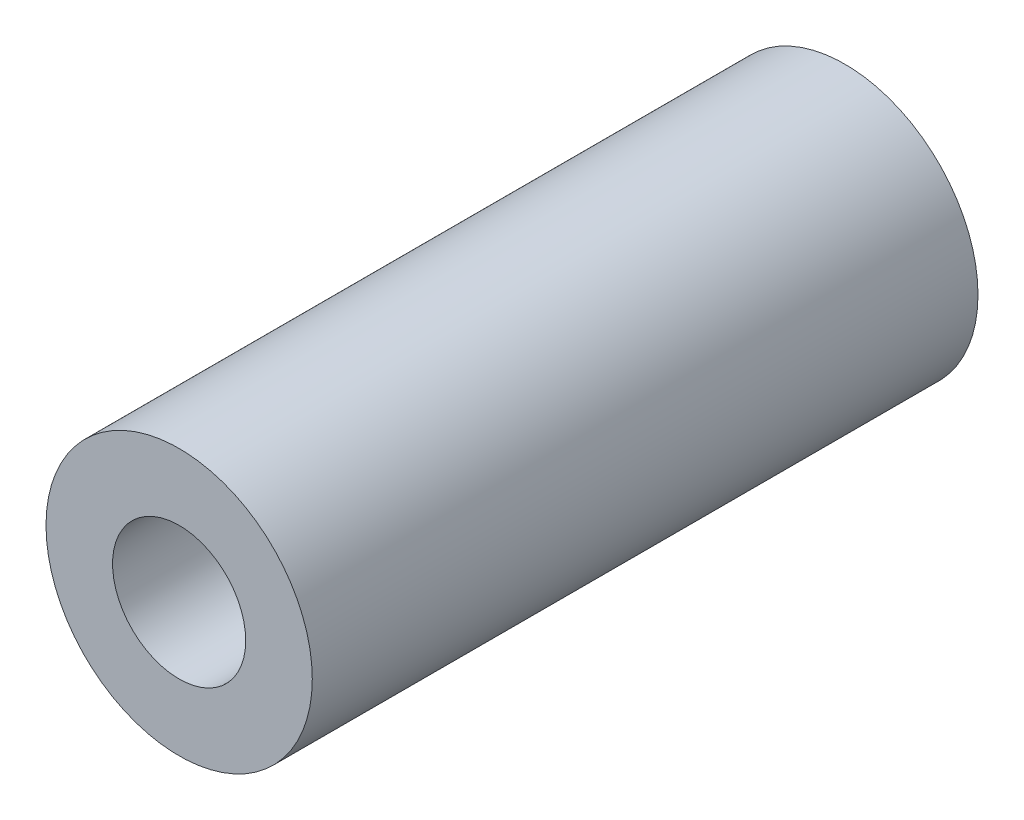
ISO-10303-21;
HEADER;
FILE_DESCRIPTION(('STEP AP214'),'2;1');
FILE_NAME('part.step','',(''),(''),'','','');
FILE_SCHEMA(('AUTOMOTIVE_DESIGN { 1 0 10303 214 1 1 1 1 }'));
ENDSEC;
DATA;
#1=APPLICATION_CONTEXT('core data for automotive mechanical design processes');
#2=APPLICATION_PROTOCOL_DEFINITION('international standard','automotive_design',2000,#1);
#3=PRODUCT_CONTEXT('',#1,'mechanical');
#4=PRODUCT('Part','Part','',(#3));
#5=PRODUCT_RELATED_PRODUCT_CATEGORY('part','',(#4));
#6=PRODUCT_DEFINITION_FORMATION('','',#4);
#7=PRODUCT_DEFINITION_CONTEXT('part definition',#1,'design');
#8=PRODUCT_DEFINITION('design','',#6,#7);
#9=PRODUCT_DEFINITION_SHAPE('','',#8);
#10=(LENGTH_UNIT() NAMED_UNIT(*) SI_UNIT(.MILLI.,.METRE.));
#11=(NAMED_UNIT(*) PLANE_ANGLE_UNIT() SI_UNIT($,.RADIAN.));
#12=(NAMED_UNIT(*) SI_UNIT($,.STERADIAN.) SOLID_ANGLE_UNIT());
#13=UNCERTAINTY_MEASURE_WITH_UNIT(LENGTH_MEASURE(1.E-05),#10,'distance_accuracy_value','');
#14=(GEOMETRIC_REPRESENTATION_CONTEXT(3) GLOBAL_UNCERTAINTY_ASSIGNED_CONTEXT((#13)) GLOBAL_UNIT_ASSIGNED_CONTEXT((#10,
#11,#12)) REPRESENTATION_CONTEXT('',''));
#15=CARTESIAN_POINT('',(0.,0.,0.));
#16=DIRECTION('',(0.,0.,1.));
#17=DIRECTION('',(1.,0.,0.));
#18=AXIS2_PLACEMENT_3D('',#15,#16,#17);
#19=CARTESIAN_POINT('',(0.,0.,10.));
#20=DIRECTION('',(0.,0.,1.));
#21=DIRECTION('',(1.,0.,0.));
#22=AXIS2_PLACEMENT_3D('',#19,#20,#21);
#23=PLANE('',#22);
#24=CARTESIAN_POINT('',(0.,0.,10.));
#25=DIRECTION('',(0.,0.,1.));
#26=DIRECTION('',(1.,0.,0.));
#27=AXIS2_PLACEMENT_3D('',#24,#25,#26);
#28=CIRCLE('',#27,2.);
#29=CARTESIAN_POINT('',(2.,0.,10.));
#30=VERTEX_POINT('',#29);
#31=EDGE_CURVE('E11',#30,#30,#28,.T.);
#32=ORIENTED_EDGE('',*,*,#31,.T.);
#33=EDGE_LOOP('',(#32));
#34=FACE_BOUND('',#33,.T.);
#35=CARTESIAN_POINT('',(0.,0.,10.));
#36=DIRECTION('',(0.,0.,1.));
#37=DIRECTION('',(1.,0.,0.));
#38=AXIS2_PLACEMENT_3D('',#35,#36,#37);
#39=CIRCLE('',#38,1.);
#40=CARTESIAN_POINT('',(1.,0.,10.));
#41=VERTEX_POINT('',#40);
#42=EDGE_CURVE('E48',#41,#41,#39,.T.);
#43=ORIENTED_EDGE('',*,*,#42,.F.);
#44=EDGE_LOOP('',(#43));
#45=FACE_BOUND('',#44,.T.);
#46=ADVANCED_FACE('F37',(#34,#45),#23,.T.);
#47=CARTESIAN_POINT('',(0.,0.,0.));
#48=DIRECTION('',(0.,0.,1.));
#49=DIRECTION('',(1.,0.,0.));
#50=AXIS2_PLACEMENT_3D('',#47,#48,#49);
#51=PLANE('',#50);
#52=CARTESIAN_POINT('',(0.,0.,0.));
#53=DIRECTION('',(0.,0.,1.));
#54=DIRECTION('',(1.,0.,0.));
#55=AXIS2_PLACEMENT_3D('',#52,#53,#54);
#56=CIRCLE('',#55,2.);
#57=CARTESIAN_POINT('',(2.,0.,0.));
#58=VERTEX_POINT('',#57);
#59=EDGE_CURVE('E41',#58,#58,#56,.T.);
#60=ORIENTED_EDGE('',*,*,#59,.F.);
#61=EDGE_LOOP('',(#60));
#62=FACE_BOUND('',#61,.T.);
#63=CARTESIAN_POINT('',(0.,0.,0.));
#64=DIRECTION('',(0.,0.,1.));
#65=DIRECTION('',(1.,0.,0.));
#66=AXIS2_PLACEMENT_3D('',#63,#64,#65);
#67=CIRCLE('',#66,1.);
#68=CARTESIAN_POINT('',(1.,0.,0.));
#69=VERTEX_POINT('',#68);
#70=EDGE_CURVE('E50',#69,#69,#67,.T.);
#71=ORIENTED_EDGE('',*,*,#70,.T.);
#72=EDGE_LOOP('',(#71));
#73=FACE_BOUND('',#72,.T.);
#74=ADVANCED_FACE('F60',(#62,#73),#51,.F.);
#75=CARTESIAN_POINT('',(0.,0.,10.));
#76=DIRECTION('',(0.,0.,-1.));
#77=DIRECTION('',(-1.,0.,0.));
#78=AXIS2_PLACEMENT_3D('',#75,#76,#77);
#79=CYLINDRICAL_SURFACE('',#78,2.);
#80=ORIENTED_EDGE('',*,*,#31,.F.);
#81=EDGE_LOOP('',(#80));
#82=FACE_BOUND('',#81,.T.);
#83=ORIENTED_EDGE('',*,*,#59,.T.);
#84=EDGE_LOOP('',(#83));
#85=FACE_BOUND('',#84,.T.);
#86=ADVANCED_FACE('F39',(#82,#85),#79,.T.);
#87=CARTESIAN_POINT('',(0.,0.,10.));
#88=DIRECTION('',(0.,0.,-1.));
#89=DIRECTION('',(-1.,0.,0.));
#90=AXIS2_PLACEMENT_3D('',#87,#88,#89);
#91=CYLINDRICAL_SURFACE('',#90,1.);
#92=ORIENTED_EDGE('',*,*,#42,.T.);
#93=EDGE_LOOP('',(#92));
#94=FACE_BOUND('',#93,.T.);
#95=ORIENTED_EDGE('',*,*,#70,.F.);
#96=EDGE_LOOP('',(#95));
#97=FACE_BOUND('',#96,.T.);
#98=ADVANCED_FACE('F56',(#94,#97),#91,.F.);
#99=CLOSED_SHELL('',(#46,#74,#86,#98));
#100=MANIFOLD_SOLID_BREP('B2',#99);
#101=ADVANCED_BREP_SHAPE_REPRESENTATION('',(#18,#100),#14);
#102=SHAPE_DEFINITION_REPRESENTATION(#9,#101);
ENDSEC;
END-ISO-10303-21;
